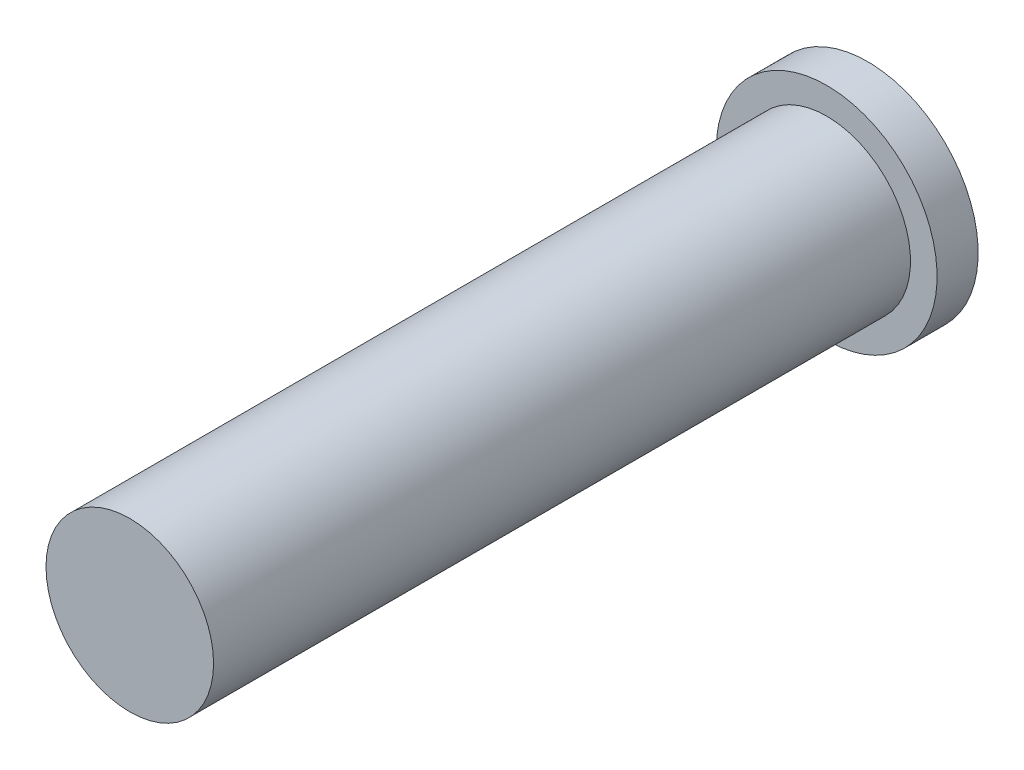
ISO-10303-21;
HEADER;
FILE_DESCRIPTION(('STEP AP214'),'2;1');
FILE_NAME('part.step','',(''),(''),'','','');
FILE_SCHEMA(('AUTOMOTIVE_DESIGN { 1 0 10303 214 1 1 1 1 }'));
ENDSEC;
DATA;
#1=APPLICATION_CONTEXT('core data for automotive mechanical design processes');
#2=APPLICATION_PROTOCOL_DEFINITION('international standard','automotive_design',2000,#1);
#3=PRODUCT_CONTEXT('',#1,'mechanical');
#4=PRODUCT('Part','Part','',(#3));
#5=PRODUCT_RELATED_PRODUCT_CATEGORY('part','',(#4));
#6=PRODUCT_DEFINITION_FORMATION('','',#4);
#7=PRODUCT_DEFINITION_CONTEXT('part definition',#1,'design');
#8=PRODUCT_DEFINITION('design','',#6,#7);
#9=PRODUCT_DEFINITION_SHAPE('','',#8);
#10=(LENGTH_UNIT() NAMED_UNIT(*) SI_UNIT(.MILLI.,.METRE.));
#11=(NAMED_UNIT(*) PLANE_ANGLE_UNIT() SI_UNIT($,.RADIAN.));
#12=(NAMED_UNIT(*) SI_UNIT($,.STERADIAN.) SOLID_ANGLE_UNIT());
#13=UNCERTAINTY_MEASURE_WITH_UNIT(LENGTH_MEASURE(1.E-05),#10,'distance_accuracy_value','');
#14=(GEOMETRIC_REPRESENTATION_CONTEXT(3) GLOBAL_UNCERTAINTY_ASSIGNED_CONTEXT((#13)) GLOBAL_UNIT_ASSIGNED_CONTEXT((#10,
#11,#12)) REPRESENTATION_CONTEXT('',''));
#15=CARTESIAN_POINT('',(0.,0.,0.));
#16=DIRECTION('',(0.,0.,1.));
#17=DIRECTION('',(1.,0.,0.));
#18=AXIS2_PLACEMENT_3D('',#15,#16,#17);
#19=CARTESIAN_POINT('',(0.,0.,6.28));
#20=DIRECTION('',(0.,0.,-1.));
#21=DIRECTION('',(-1.,0.,0.));
#22=AXIS2_PLACEMENT_3D('',#19,#20,#21);
#23=CYLINDRICAL_SURFACE('',#22,0.755);
#24=CARTESIAN_POINT('',(0.,0.,6.28));
#25=DIRECTION('',(0.,0.,1.));
#26=DIRECTION('',(1.,0.,0.));
#27=AXIS2_PLACEMENT_3D('',#24,#25,#26);
#28=CIRCLE('',#27,0.755);
#29=CARTESIAN_POINT('',(0.755,0.,6.28));
#30=VERTEX_POINT('',#29);
#31=EDGE_CURVE('E10',#30,#30,#28,.T.);
#32=ORIENTED_EDGE('',*,*,#31,.F.);
#33=EDGE_LOOP('',(#32));
#34=FACE_BOUND('',#33,.T.);
#35=CARTESIAN_POINT('',(0.,0.,0.));
#36=DIRECTION('',(0.,0.,-1.));
#37=DIRECTION('',(-1.,0.,0.));
#38=AXIS2_PLACEMENT_3D('',#35,#36,#37);
#39=CIRCLE('',#38,0.755);
#40=CARTESIAN_POINT('',(-0.755,0.,0.));
#41=VERTEX_POINT('',#40);
#42=EDGE_CURVE('E36',#41,#41,#39,.T.);
#43=ORIENTED_EDGE('',*,*,#42,.F.);
#44=EDGE_LOOP('',(#43));
#45=FACE_BOUND('',#44,.T.);
#46=ADVANCED_FACE('F30',(#34,#45),#23,.T.);
#47=CARTESIAN_POINT('',(0.,0.,6.28));
#48=DIRECTION('',(0.,0.,1.));
#49=DIRECTION('',(1.,0.,0.));
#50=AXIS2_PLACEMENT_3D('',#47,#48,#49);
#51=PLANE('',#50);
#52=ORIENTED_EDGE('',*,*,#31,.T.);
#53=EDGE_LOOP('',(#52));
#54=FACE_BOUND('',#53,.T.);
#55=ADVANCED_FACE('F78',(#54),#51,.T.);
#56=CARTESIAN_POINT('',(0.,0.,0.));
#57=DIRECTION('',(0.,0.,-1.));
#58=DIRECTION('',(-1.,0.,0.));
#59=AXIS2_PLACEMENT_3D('',#56,#57,#58);
#60=PLANE('',#59);
#61=CARTESIAN_POINT('',(0.,0.,0.));
#62=DIRECTION('',(0.,0.,-1.));
#63=DIRECTION('',(-1.,0.,0.));
#64=AXIS2_PLACEMENT_3D('',#61,#62,#63);
#65=CIRCLE('',#64,0.995);
#66=CARTESIAN_POINT('',(-0.995,0.,0.));
#67=VERTEX_POINT('',#66);
#68=EDGE_CURVE('E44',#67,#67,#65,.T.);
#69=ORIENTED_EDGE('',*,*,#68,.F.);
#70=EDGE_LOOP('',(#69));
#71=FACE_BOUND('',#70,.T.);
#72=ORIENTED_EDGE('',*,*,#42,.T.);
#73=EDGE_LOOP('',(#72));
#74=FACE_BOUND('',#73,.T.);
#75=ADVANCED_FACE('F73',(#71,#74),#60,.F.);
#76=CARTESIAN_POINT('',(0.,0.,-0.37));
#77=DIRECTION('',(0.,0.,1.));
#78=DIRECTION('',(1.,0.,0.));
#79=AXIS2_PLACEMENT_3D('',#76,#77,#78);
#80=CYLINDRICAL_SURFACE('',#79,0.995);
#81=CARTESIAN_POINT('',(0.,0.,-0.37));
#82=DIRECTION('',(0.,0.,-1.));
#83=DIRECTION('',(-1.,0.,0.));
#84=AXIS2_PLACEMENT_3D('',#81,#82,#83);
#85=CIRCLE('',#84,0.995);
#86=CARTESIAN_POINT('',(-0.995,0.,-0.37));
#87=VERTEX_POINT('',#86);
#88=EDGE_CURVE('E40',#87,#87,#85,.T.);
#89=ORIENTED_EDGE('',*,*,#88,.F.);
#90=EDGE_LOOP('',(#89));
#91=FACE_BOUND('',#90,.T.);
#92=ORIENTED_EDGE('',*,*,#68,.T.);
#93=EDGE_LOOP('',(#92));
#94=FACE_BOUND('',#93,.T.);
#95=ADVANCED_FACE('F67',(#91,#94),#80,.T.);
#96=CARTESIAN_POINT('',(0.,0.,-0.37));
#97=DIRECTION('',(0.,0.,-1.));
#98=DIRECTION('',(-1.,0.,0.));
#99=AXIS2_PLACEMENT_3D('',#96,#97,#98);
#100=PLANE('',#99);
#101=CARTESIAN_POINT('',(0.,0.,-0.37));
#102=DIRECTION('',(0.,0.,-1.));
#103=DIRECTION('',(-1.,0.,0.));
#104=AXIS2_PLACEMENT_3D('',#101,#102,#103);
#105=CIRCLE('',#104,0.58);
#106=CARTESIAN_POINT('',(-0.58,0.,-0.37));
#107=VERTEX_POINT('',#106);
#108=EDGE_CURVE('E50',#107,#107,#105,.T.);
#109=ORIENTED_EDGE('',*,*,#108,.F.);
#110=EDGE_LOOP('',(#109));
#111=FACE_BOUND('',#110,.T.);
#112=ORIENTED_EDGE('',*,*,#88,.T.);
#113=EDGE_LOOP('',(#112));
#114=FACE_BOUND('',#113,.T.);
#115=ADVANCED_FACE('F61',(#111,#114),#100,.T.);
#116=CARTESIAN_POINT('',(0.,0.,5.63));
#117=DIRECTION('',(0.,0.,-1.));
#118=DIRECTION('',(-1.,0.,0.));
#119=AXIS2_PLACEMENT_3D('',#116,#117,#118);
#120=CYLINDRICAL_SURFACE('',#119,0.58);
#121=CARTESIAN_POINT('',(0.,0.,5.63));
#122=DIRECTION('',(0.,0.,-1.));
#123=DIRECTION('',(-1.,0.,0.));
#124=AXIS2_PLACEMENT_3D('',#121,#122,#123);
#125=CIRCLE('',#124,0.58);
#126=CARTESIAN_POINT('',(-0.58,0.,5.63));
#127=VERTEX_POINT('',#126);
#128=EDGE_CURVE('E48',#127,#127,#125,.T.);
#129=ORIENTED_EDGE('',*,*,#128,.F.);
#130=EDGE_LOOP('',(#129));
#131=FACE_BOUND('',#130,.T.);
#132=ORIENTED_EDGE('',*,*,#108,.T.);
#133=EDGE_LOOP('',(#132));
#134=FACE_BOUND('',#133,.T.);
#135=ADVANCED_FACE('F58',(#131,#134),#120,.F.);
#136=CARTESIAN_POINT('',(0.,0.,5.63));
#137=DIRECTION('',(0.,0.,-1.));
#138=DIRECTION('',(-1.,0.,0.));
#139=AXIS2_PLACEMENT_3D('',#136,#137,#138);
#140=PLANE('',#139);
#141=ORIENTED_EDGE('',*,*,#128,.T.);
#142=EDGE_LOOP('',(#141));
#143=FACE_BOUND('',#142,.T.);
#144=ADVANCED_FACE('F56',(#143),#140,.T.);
#145=CLOSED_SHELL('',(#46,#55,#75,#95,#115,#135,#144));
#146=MANIFOLD_SOLID_BREP('B2',#145);
#147=ADVANCED_BREP_SHAPE_REPRESENTATION('',(#18,#146),#14);
#148=SHAPE_DEFINITION_REPRESENTATION(#9,#147);
ENDSEC;
END-ISO-10303-21;
